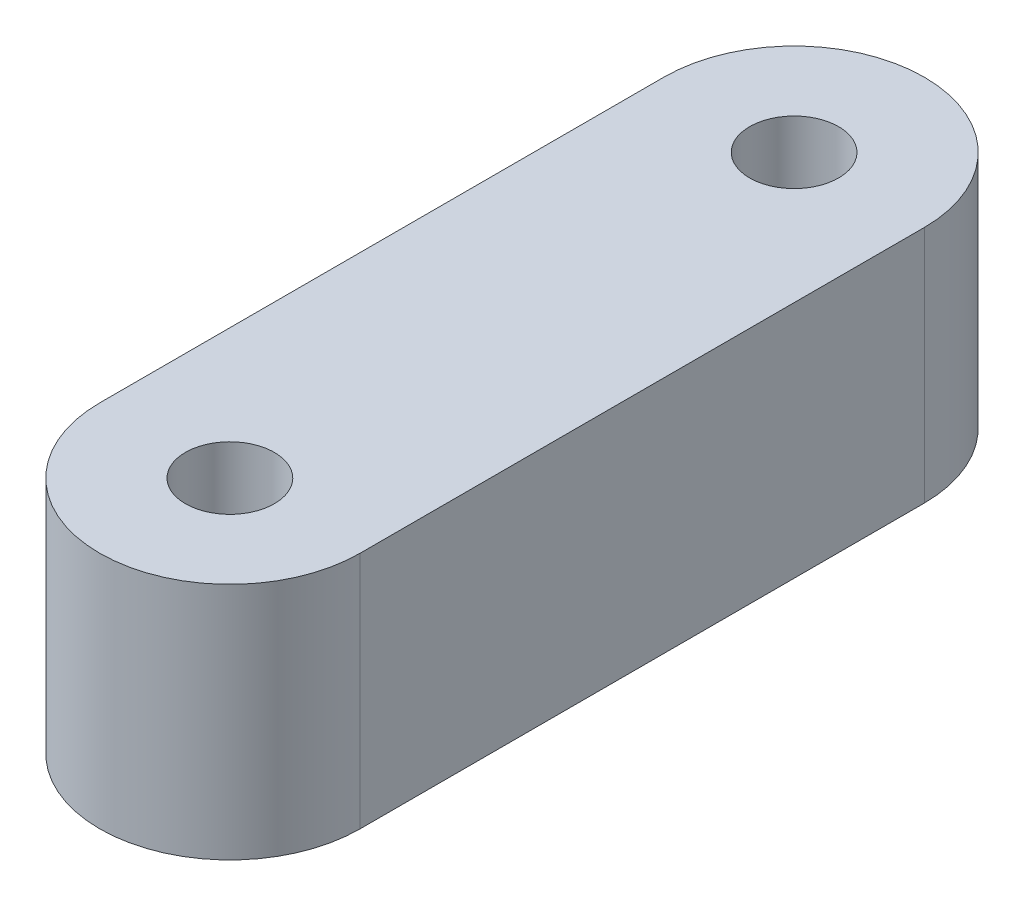
ISO-10303-21;
HEADER;
FILE_DESCRIPTION(('STEP AP214'),'2;1');
FILE_NAME('part.step','',(''),(''),'','','');
FILE_SCHEMA(('AUTOMOTIVE_DESIGN { 1 0 10303 214 1 1 1 1 }'));
ENDSEC;
DATA;
#1=APPLICATION_CONTEXT('core data for automotive mechanical design processes');
#2=APPLICATION_PROTOCOL_DEFINITION('international standard','automotive_design',2000,#1);
#3=PRODUCT_CONTEXT('',#1,'mechanical');
#4=PRODUCT('Part','Part','',(#3));
#5=PRODUCT_RELATED_PRODUCT_CATEGORY('part','',(#4));
#6=PRODUCT_DEFINITION_FORMATION('','',#4);
#7=PRODUCT_DEFINITION_CONTEXT('part definition',#1,'design');
#8=PRODUCT_DEFINITION('design','',#6,#7);
#9=PRODUCT_DEFINITION_SHAPE('','',#8);
#10=(LENGTH_UNIT() NAMED_UNIT(*) SI_UNIT(.MILLI.,.METRE.));
#11=(NAMED_UNIT(*) PLANE_ANGLE_UNIT() SI_UNIT($,.RADIAN.));
#12=(NAMED_UNIT(*) SI_UNIT($,.STERADIAN.) SOLID_ANGLE_UNIT());
#13=UNCERTAINTY_MEASURE_WITH_UNIT(LENGTH_MEASURE(1.E-05),#10,'distance_accuracy_value','');
#14=(GEOMETRIC_REPRESENTATION_CONTEXT(3) GLOBAL_UNCERTAINTY_ASSIGNED_CONTEXT((#13)) GLOBAL_UNIT_ASSIGNED_CONTEXT((#10,
#11,#12)) REPRESENTATION_CONTEXT('',''));
#15=CARTESIAN_POINT('',(0.,0.,0.));
#16=DIRECTION('',(0.,0.,1.));
#17=DIRECTION('',(1.,0.,0.));
#18=AXIS2_PLACEMENT_3D('',#15,#16,#17);
#19=CARTESIAN_POINT('',(0.,11.,13.));
#20=DIRECTION('',(0.,-1.,0.));
#21=DIRECTION('',(0.,0.,-1.));
#22=AXIS2_PLACEMENT_3D('',#19,#20,#21);
#23=CYLINDRICAL_SURFACE('',#22,6.);
#24=CARTESIAN_POINT('',(0.,0.,13.));
#25=DIRECTION('',(0.,1.,0.));
#26=DIRECTION('',(0.,0.,1.));
#27=AXIS2_PLACEMENT_3D('',#24,#25,#26);
#28=CIRCLE('',#27,6.);
#29=CARTESIAN_POINT('',(-6.,0.,13.));
#30=VERTEX_POINT('',#29);
#31=CARTESIAN_POINT('',(6.,0.,13.));
#32=VERTEX_POINT('',#31);
#33=EDGE_CURVE('E106',#30,#32,#28,.T.);
#34=ORIENTED_EDGE('',*,*,#33,.T.);
#35=DIRECTION('',(0.,-1.,0.));
#36=VECTOR('',#35,1.);
#37=CARTESIAN_POINT('',(6.,11.,13.));
#38=LINE('',#37,#36);
#39=CARTESIAN_POINT('',(6.,11.,13.));
#40=VERTEX_POINT('',#39);
#41=EDGE_CURVE('E11',#40,#32,#38,.T.);
#42=ORIENTED_EDGE('',*,*,#41,.F.);
#43=CARTESIAN_POINT('',(0.,11.,13.));
#44=DIRECTION('',(0.,1.,0.));
#45=DIRECTION('',(0.,0.,1.));
#46=AXIS2_PLACEMENT_3D('',#43,#44,#45);
#47=CIRCLE('',#46,6.);
#48=CARTESIAN_POINT('',(-6.,11.,13.));
#49=VERTEX_POINT('',#48);
#50=EDGE_CURVE('E90',#49,#40,#47,.T.);
#51=ORIENTED_EDGE('',*,*,#50,.F.);
#52=DIRECTION('',(0.,-1.,0.));
#53=VECTOR('',#52,1.);
#54=CARTESIAN_POINT('',(-6.,11.,13.));
#55=LINE('',#54,#53);
#56=EDGE_CURVE('E102',#49,#30,#55,.T.);
#57=ORIENTED_EDGE('',*,*,#56,.T.);
#58=EDGE_LOOP('',(#34,#42,#51,#57));
#59=FACE_BOUND('',#58,.T.);
#60=ADVANCED_FACE('F38',(#59),#23,.T.);
#61=CARTESIAN_POINT('',(6.,11.,13.));
#62=DIRECTION('',(-1.,0.,0.));
#63=DIRECTION('',(0.,0.,1.));
#64=AXIS2_PLACEMENT_3D('',#61,#62,#63);
#65=PLANE('',#64);
#66=DIRECTION('',(0.,0.,-1.));
#67=VECTOR('',#66,1.);
#68=CARTESIAN_POINT('',(6.,0.,13.));
#69=LINE('',#68,#67);
#70=CARTESIAN_POINT('',(6.,0.,-13.));
#71=VERTEX_POINT('',#70);
#72=EDGE_CURVE('E95',#32,#71,#69,.T.);
#73=ORIENTED_EDGE('',*,*,#72,.T.);
#74=DIRECTION('',(0.,-1.,0.));
#75=VECTOR('',#74,1.);
#76=CARTESIAN_POINT('',(6.,11.,-13.));
#77=LINE('',#76,#75);
#78=CARTESIAN_POINT('',(6.,11.,-13.));
#79=VERTEX_POINT('',#78);
#80=EDGE_CURVE('E47',#79,#71,#77,.T.);
#81=ORIENTED_EDGE('',*,*,#80,.F.);
#82=DIRECTION('',(0.,0.,-1.));
#83=VECTOR('',#82,1.);
#84=CARTESIAN_POINT('',(6.,11.,13.));
#85=LINE('',#84,#83);
#86=EDGE_CURVE('E85',#40,#79,#85,.T.);
#87=ORIENTED_EDGE('',*,*,#86,.F.);
#88=ORIENTED_EDGE('',*,*,#41,.T.);
#89=EDGE_LOOP('',(#73,#81,#87,#88));
#90=FACE_BOUND('',#89,.T.);
#91=ADVANCED_FACE('F94',(#90),#65,.F.);
#92=CARTESIAN_POINT('',(0.,11.,-13.));
#93=DIRECTION('',(0.,-1.,0.));
#94=DIRECTION('',(0.,0.,-1.));
#95=AXIS2_PLACEMENT_3D('',#92,#93,#94);
#96=CYLINDRICAL_SURFACE('',#95,6.);
#97=CARTESIAN_POINT('',(0.,0.,-13.));
#98=DIRECTION('',(0.,1.,0.));
#99=DIRECTION('',(0.,0.,1.));
#100=AXIS2_PLACEMENT_3D('',#97,#98,#99);
#101=CIRCLE('',#100,6.);
#102=CARTESIAN_POINT('',(-6.00000000000001,0.,-13.));
#103=VERTEX_POINT('',#102);
#104=EDGE_CURVE('E72',#71,#103,#101,.T.);
#105=ORIENTED_EDGE('',*,*,#104,.T.);
#106=DIRECTION('',(0.,-1.,0.));
#107=VECTOR('',#106,1.);
#108=CARTESIAN_POINT('',(-6.00000000000001,11.,-13.));
#109=LINE('',#108,#107);
#110=CARTESIAN_POINT('',(-6.00000000000001,11.,-13.));
#111=VERTEX_POINT('',#110);
#112=EDGE_CURVE('E97',#111,#103,#109,.T.);
#113=ORIENTED_EDGE('',*,*,#112,.F.);
#114=CARTESIAN_POINT('',(0.,11.,-13.));
#115=DIRECTION('',(0.,1.,0.));
#116=DIRECTION('',(0.,0.,1.));
#117=AXIS2_PLACEMENT_3D('',#114,#115,#116);
#118=CIRCLE('',#117,6.);
#119=EDGE_CURVE('E88',#79,#111,#118,.T.);
#120=ORIENTED_EDGE('',*,*,#119,.F.);
#121=ORIENTED_EDGE('',*,*,#80,.T.);
#122=EDGE_LOOP('',(#105,#113,#120,#121));
#123=FACE_BOUND('',#122,.T.);
#124=ADVANCED_FACE('F98',(#123),#96,.T.);
#125=CARTESIAN_POINT('',(-6.,11.,13.));
#126=DIRECTION('',(1.,0.,0.));
#127=DIRECTION('',(0.,0.,-1.));
#128=AXIS2_PLACEMENT_3D('',#125,#126,#127);
#129=PLANE('',#128);
#130=CARTESIAN_POINT('',(-6.,5.5,0.));
#131=DIRECTION('',(-1.,0.,0.));
#132=DIRECTION('',(0.,0.,1.));
#133=AXIS2_PLACEMENT_3D('',#130,#131,#132);
#134=CIRCLE('',#133,3.1);
#135=CARTESIAN_POINT('',(-6.,5.5,3.1));
#136=VERTEX_POINT('',#135);
#137=EDGE_CURVE('E143',#136,#136,#134,.T.);
#138=ORIENTED_EDGE('',*,*,#137,.F.);
#139=EDGE_LOOP('',(#138));
#140=FACE_BOUND('',#139,.T.);
#141=DIRECTION('',(0.,0.,1.));
#142=VECTOR('',#141,1.);
#143=CARTESIAN_POINT('',(-6.,0.,13.));
#144=LINE('',#143,#142);
#145=EDGE_CURVE('E78',#103,#30,#144,.T.);
#146=ORIENTED_EDGE('',*,*,#145,.T.);
#147=ORIENTED_EDGE('',*,*,#56,.F.);
#148=DIRECTION('',(0.,0.,1.));
#149=VECTOR('',#148,1.);
#150=CARTESIAN_POINT('',(-6.,11.,13.));
#151=LINE('',#150,#149);
#152=EDGE_CURVE('E55',#111,#49,#151,.T.);
#153=ORIENTED_EDGE('',*,*,#152,.F.);
#154=ORIENTED_EDGE('',*,*,#112,.T.);
#155=EDGE_LOOP('',(#146,#147,#153,#154));
#156=FACE_BOUND('',#155,.T.);
#157=ADVANCED_FACE('F120',(#140,#156),#129,.F.);
#158=CARTESIAN_POINT('',(0.,11.,13.));
#159=DIRECTION('',(0.,1.,0.));
#160=DIRECTION('',(0.,0.,1.));
#161=AXIS2_PLACEMENT_3D('',#158,#159,#160);
#162=PLANE('',#161);
#163=CARTESIAN_POINT('',(0.,11.,-13.));
#164=DIRECTION('',(0.,1.,0.));
#165=DIRECTION('',(0.,0.,1.));
#166=AXIS2_PLACEMENT_3D('',#163,#164,#165);
#167=CIRCLE('',#166,2.05);
#168=CARTESIAN_POINT('',(0.,11.,-10.95));
#169=VERTEX_POINT('',#168);
#170=EDGE_CURVE('E136',#169,#169,#167,.T.);
#171=ORIENTED_EDGE('',*,*,#170,.F.);
#172=EDGE_LOOP('',(#171));
#173=FACE_BOUND('',#172,.T.);
#174=CARTESIAN_POINT('',(0.,11.,13.));
#175=DIRECTION('',(0.,1.,0.));
#176=DIRECTION('',(0.,0.,1.));
#177=AXIS2_PLACEMENT_3D('',#174,#175,#176);
#178=CIRCLE('',#177,2.05);
#179=CARTESIAN_POINT('',(0.,11.,15.05));
#180=VERTEX_POINT('',#179);
#181=EDGE_CURVE('E127',#180,#180,#178,.T.);
#182=ORIENTED_EDGE('',*,*,#181,.F.);
#183=EDGE_LOOP('',(#182));
#184=FACE_BOUND('',#183,.T.);
#185=ORIENTED_EDGE('',*,*,#50,.T.);
#186=ORIENTED_EDGE('',*,*,#86,.T.);
#187=ORIENTED_EDGE('',*,*,#119,.T.);
#188=ORIENTED_EDGE('',*,*,#152,.T.);
#189=EDGE_LOOP('',(#185,#186,#187,#188));
#190=FACE_BOUND('',#189,.T.);
#191=ADVANCED_FACE('F86',(#173,#184,#190),#162,.T.);
#192=CARTESIAN_POINT('',(0.,0.,13.));
#193=DIRECTION('',(0.,1.,0.));
#194=DIRECTION('',(0.,0.,1.));
#195=AXIS2_PLACEMENT_3D('',#192,#193,#194);
#196=PLANE('',#195);
#197=CARTESIAN_POINT('',(0.,0.,-13.));
#198=DIRECTION('',(0.,1.,0.));
#199=DIRECTION('',(0.,0.,1.));
#200=AXIS2_PLACEMENT_3D('',#197,#198,#199);
#201=CIRCLE('',#200,2.05);
#202=CARTESIAN_POINT('',(0.,0.,-10.95));
#203=VERTEX_POINT('',#202);
#204=EDGE_CURVE('E110',#203,#203,#201,.T.);
#205=ORIENTED_EDGE('',*,*,#204,.T.);
#206=EDGE_LOOP('',(#205));
#207=FACE_BOUND('',#206,.T.);
#208=CARTESIAN_POINT('',(0.,0.,13.));
#209=DIRECTION('',(0.,1.,0.));
#210=DIRECTION('',(0.,0.,1.));
#211=AXIS2_PLACEMENT_3D('',#208,#209,#210);
#212=CIRCLE('',#211,2.05);
#213=CARTESIAN_POINT('',(0.,0.,15.05));
#214=VERTEX_POINT('',#213);
#215=EDGE_CURVE('E131',#214,#214,#212,.T.);
#216=ORIENTED_EDGE('',*,*,#215,.T.);
#217=EDGE_LOOP('',(#216));
#218=FACE_BOUND('',#217,.T.);
#219=ORIENTED_EDGE('',*,*,#33,.F.);
#220=ORIENTED_EDGE('',*,*,#145,.F.);
#221=ORIENTED_EDGE('',*,*,#104,.F.);
#222=ORIENTED_EDGE('',*,*,#72,.F.);
#223=EDGE_LOOP('',(#219,#220,#221,#222));
#224=FACE_BOUND('',#223,.T.);
#225=ADVANCED_FACE('F123',(#207,#218,#224),#196,.F.);
#226=CARTESIAN_POINT('',(0.,0.,13.));
#227=DIRECTION('',(0.,1.,0.));
#228=DIRECTION('',(0.,0.,1.));
#229=AXIS2_PLACEMENT_3D('',#226,#227,#228);
#230=CYLINDRICAL_SURFACE('',#229,2.05);
#231=ORIENTED_EDGE('',*,*,#215,.F.);
#232=EDGE_LOOP('',(#231));
#233=FACE_BOUND('',#232,.T.);
#234=ORIENTED_EDGE('',*,*,#181,.T.);
#235=EDGE_LOOP('',(#234));
#236=FACE_BOUND('',#235,.T.);
#237=ADVANCED_FACE('F199',(#233,#236),#230,.F.);
#238=CARTESIAN_POINT('',(0.,0.,-13.));
#239=DIRECTION('',(0.,1.,0.));
#240=DIRECTION('',(0.,0.,1.));
#241=AXIS2_PLACEMENT_3D('',#238,#239,#240);
#242=CYLINDRICAL_SURFACE('',#241,2.05);
#243=ORIENTED_EDGE('',*,*,#204,.F.);
#244=EDGE_LOOP('',(#243));
#245=FACE_BOUND('',#244,.T.);
#246=ORIENTED_EDGE('',*,*,#170,.T.);
#247=EDGE_LOOP('',(#246));
#248=FACE_BOUND('',#247,.T.);
#249=ADVANCED_FACE('F156',(#245,#248),#242,.F.);
#250=CARTESIAN_POINT('',(4.,5.5,0.));
#251=DIRECTION('',(-1.,0.,0.));
#252=DIRECTION('',(0.,0.,1.));
#253=AXIS2_PLACEMENT_3D('',#250,#251,#252);
#254=CYLINDRICAL_SURFACE('',#253,3.1);
#255=CARTESIAN_POINT('',(4.,5.5,0.));
#256=DIRECTION('',(-1.,0.,0.));
#257=DIRECTION('',(0.,0.,1.));
#258=AXIS2_PLACEMENT_3D('',#255,#256,#257);
#259=CIRCLE('',#258,3.1);
#260=CARTESIAN_POINT('',(4.,5.5,3.1));
#261=VERTEX_POINT('',#260);
#262=EDGE_CURVE('E132',#261,#261,#259,.T.);
#263=ORIENTED_EDGE('',*,*,#262,.F.);
#264=EDGE_LOOP('',(#263));
#265=FACE_BOUND('',#264,.T.);
#266=ORIENTED_EDGE('',*,*,#137,.T.);
#267=EDGE_LOOP('',(#266));
#268=FACE_BOUND('',#267,.T.);
#269=ADVANCED_FACE('F153',(#265,#268),#254,.F.);
#270=CARTESIAN_POINT('',(4.,5.5,0.));
#271=DIRECTION('',(-1.,0.,0.));
#272=DIRECTION('',(0.,0.,1.));
#273=AXIS2_PLACEMENT_3D('',#270,#271,#272);
#274=PLANE('',#273);
#275=ORIENTED_EDGE('',*,*,#262,.T.);
#276=EDGE_LOOP('',(#275));
#277=FACE_BOUND('',#276,.T.);
#278=ADVANCED_FACE('F151',(#277),#274,.T.);
#279=CLOSED_SHELL('',(#60,#91,#124,#157,#191,#225,#237,#249,#269,#278));
#280=MANIFOLD_SOLID_BREP('B2',#279);
#281=ADVANCED_BREP_SHAPE_REPRESENTATION('',(#18,#280),#14);
#282=SHAPE_DEFINITION_REPRESENTATION(#9,#281);
ENDSEC;
END-ISO-10303-21;
